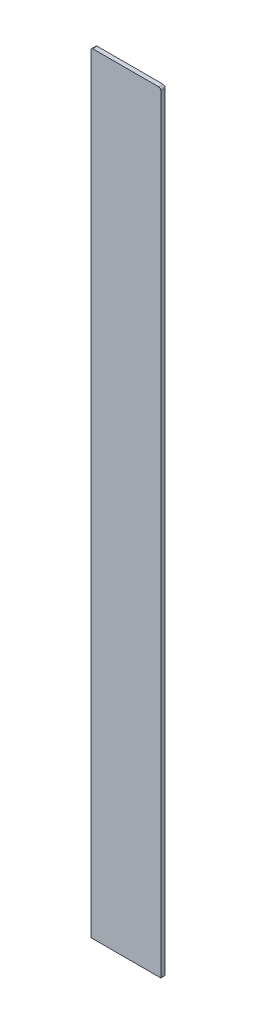
ISO-10303-21;
HEADER;
FILE_DESCRIPTION(('STEP AP214'),'2;1');
FILE_NAME('part.step','',(''),(''),'','','');
FILE_SCHEMA(('AUTOMOTIVE_DESIGN { 1 0 10303 214 1 1 1 1 }'));
ENDSEC;
DATA;
#1=APPLICATION_CONTEXT('core data for automotive mechanical design processes');
#2=APPLICATION_PROTOCOL_DEFINITION('international standard','automotive_design',2000,#1);
#3=PRODUCT_CONTEXT('',#1,'mechanical');
#4=PRODUCT('Part','Part','',(#3));
#5=PRODUCT_RELATED_PRODUCT_CATEGORY('part','',(#4));
#6=PRODUCT_DEFINITION_FORMATION('','',#4);
#7=PRODUCT_DEFINITION_CONTEXT('part definition',#1,'design');
#8=PRODUCT_DEFINITION('design','',#6,#7);
#9=PRODUCT_DEFINITION_SHAPE('','',#8);
#10=(LENGTH_UNIT() NAMED_UNIT(*) SI_UNIT(.MILLI.,.METRE.));
#11=(NAMED_UNIT(*) PLANE_ANGLE_UNIT() SI_UNIT($,.RADIAN.));
#12=(NAMED_UNIT(*) SI_UNIT($,.STERADIAN.) SOLID_ANGLE_UNIT());
#13=UNCERTAINTY_MEASURE_WITH_UNIT(LENGTH_MEASURE(1.E-05),#10,'distance_accuracy_value','');
#14=(GEOMETRIC_REPRESENTATION_CONTEXT(3) GLOBAL_UNCERTAINTY_ASSIGNED_CONTEXT((#13)) GLOBAL_UNIT_ASSIGNED_CONTEXT((#10,
#11,#12)) REPRESENTATION_CONTEXT('',''));
#15=CARTESIAN_POINT('',(0.,0.,0.));
#16=DIRECTION('',(0.,0.,1.));
#17=DIRECTION('',(1.,0.,0.));
#18=AXIS2_PLACEMENT_3D('',#15,#16,#17);
#19=CARTESIAN_POINT('',(4.,0.,0.105));
#20=DIRECTION('',(1.,0.,0.));
#21=DIRECTION('',(0.,1.,0.));
#22=AXIS2_PLACEMENT_3D('',#19,#20,#21);
#23=PLANE('',#22);
#24=DIRECTION('',(0.,0.,-1.));
#25=VECTOR('',#24,1.);
#26=CARTESIAN_POINT('',(4.00000000000001,-84.,0.105));
#27=LINE('',#26,#25);
#28=CARTESIAN_POINT('',(4.00000000000001,-84.,0.305));
#29=VERTEX_POINT('',#28);
#30=CARTESIAN_POINT('',(4.00000000000001,-84.,-0.2));
#31=VERTEX_POINT('',#30);
#32=EDGE_CURVE('E189',#29,#31,#27,.T.);
#33=ORIENTED_EDGE('',*,*,#32,.T.);
#34=DIRECTION('',(0.,-1.,0.));
#35=VECTOR('',#34,1.);
#36=CARTESIAN_POINT('',(4.,0.,-0.2));
#37=LINE('',#36,#35);
#38=CARTESIAN_POINT('',(4.,3.75,-0.2));
#39=VERTEX_POINT('',#38);
#40=EDGE_CURVE('E176',#39,#31,#37,.T.);
#41=ORIENTED_EDGE('',*,*,#40,.F.);
#42=DIRECTION('',(0.,0.,-1.));
#43=VECTOR('',#42,1.);
#44=CARTESIAN_POINT('',(4.,3.75,0.105));
#45=LINE('',#44,#43);
#46=CARTESIAN_POINT('',(4.,3.75,0.305));
#47=VERTEX_POINT('',#46);
#48=EDGE_CURVE('E205',#39,#47,#45,.F.);
#49=ORIENTED_EDGE('',*,*,#48,.T.);
#50=DIRECTION('',(0.,1.,0.));
#51=VECTOR('',#50,1.);
#52=CARTESIAN_POINT('',(4.,0.,0.305));
#53=LINE('',#52,#51);
#54=EDGE_CURVE('E150',#29,#47,#53,.T.);
#55=ORIENTED_EDGE('',*,*,#54,.F.);
#56=EDGE_LOOP('',(#33,#41,#49,#55));
#57=FACE_BOUND('',#56,.T.);
#58=ADVANCED_FACE('F35',(#57),#23,.T.);
#59=CARTESIAN_POINT('',(0.,4.,0.105));
#60=DIRECTION('',(0.,1.,0.));
#61=DIRECTION('',(0.,0.,1.));
#62=AXIS2_PLACEMENT_3D('',#59,#60,#61);
#63=PLANE('',#62);
#64=DIRECTION('',(0.,0.,-1.));
#65=VECTOR('',#64,1.);
#66=CARTESIAN_POINT('',(3.75,4.,0.105));
#67=LINE('',#66,#65);
#68=CARTESIAN_POINT('',(3.75,4.,0.305));
#69=VERTEX_POINT('',#68);
#70=CARTESIAN_POINT('',(3.75,4.,-0.2));
#71=VERTEX_POINT('',#70);
#72=EDGE_CURVE('E125',#69,#71,#67,.T.);
#73=ORIENTED_EDGE('',*,*,#72,.T.);
#74=DIRECTION('',(1.,0.,0.));
#75=VECTOR('',#74,1.);
#76=CARTESIAN_POINT('',(0.,4.,-0.2));
#77=LINE('',#76,#75);
#78=CARTESIAN_POINT('',(-3.75,4.,-0.2));
#79=VERTEX_POINT('',#78);
#80=EDGE_CURVE('E173',#79,#71,#77,.T.);
#81=ORIENTED_EDGE('',*,*,#80,.F.);
#82=DIRECTION('',(0.,0.,-1.));
#83=VECTOR('',#82,1.);
#84=CARTESIAN_POINT('',(-3.75,4.,0.105));
#85=LINE('',#84,#83);
#86=CARTESIAN_POINT('',(-3.75,4.,0.305));
#87=VERTEX_POINT('',#86);
#88=EDGE_CURVE('E135',#79,#87,#85,.F.);
#89=ORIENTED_EDGE('',*,*,#88,.T.);
#90=DIRECTION('',(-1.,0.,0.));
#91=VECTOR('',#90,1.);
#92=CARTESIAN_POINT('',(0.,4.,0.305));
#93=LINE('',#92,#91);
#94=EDGE_CURVE('E139',#69,#87,#93,.T.);
#95=ORIENTED_EDGE('',*,*,#94,.F.);
#96=EDGE_LOOP('',(#73,#81,#89,#95));
#97=FACE_BOUND('',#96,.T.);
#98=ADVANCED_FACE('F140',(#97),#63,.T.);
#99=CARTESIAN_POINT('',(-4.,0.,0.105));
#100=DIRECTION('',(-1.,0.,0.));
#101=DIRECTION('',(0.,0.,1.));
#102=AXIS2_PLACEMENT_3D('',#99,#100,#101);
#103=PLANE('',#102);
#104=DIRECTION('',(0.,0.,-1.));
#105=VECTOR('',#104,1.);
#106=CARTESIAN_POINT('',(-3.99999999999999,-84.,0.105));
#107=LINE('',#106,#105);
#108=CARTESIAN_POINT('',(-3.99999999999999,-84.,0.305));
#109=VERTEX_POINT('',#108);
#110=CARTESIAN_POINT('',(-3.99999999999999,-84.,-0.2));
#111=VERTEX_POINT('',#110);
#112=EDGE_CURVE('E201',#109,#111,#107,.T.);
#113=ORIENTED_EDGE('',*,*,#112,.F.);
#114=DIRECTION('',(0.,-1.,0.));
#115=VECTOR('',#114,1.);
#116=CARTESIAN_POINT('',(-4.,0.,0.305));
#117=LINE('',#116,#115);
#118=CARTESIAN_POINT('',(-4.,3.75,0.305));
#119=VERTEX_POINT('',#118);
#120=EDGE_CURVE('E157',#119,#109,#117,.T.);
#121=ORIENTED_EDGE('',*,*,#120,.F.);
#122=DIRECTION('',(0.,0.,-1.));
#123=VECTOR('',#122,1.);
#124=CARTESIAN_POINT('',(-4.,3.75,0.105));
#125=LINE('',#124,#123);
#126=CARTESIAN_POINT('',(-4.,3.75,-0.2));
#127=VERTEX_POINT('',#126);
#128=EDGE_CURVE('E136',#119,#127,#125,.T.);
#129=ORIENTED_EDGE('',*,*,#128,.T.);
#130=DIRECTION('',(0.,1.,0.));
#131=VECTOR('',#130,1.);
#132=CARTESIAN_POINT('',(-4.,0.,-0.2));
#133=LINE('',#132,#131);
#134=EDGE_CURVE('E167',#111,#127,#133,.T.);
#135=ORIENTED_EDGE('',*,*,#134,.F.);
#136=EDGE_LOOP('',(#113,#121,#129,#135));
#137=FACE_BOUND('',#136,.T.);
#138=ADVANCED_FACE('F251',(#137),#103,.T.);
#139=CARTESIAN_POINT('',(-2.75,0.,0.105));
#140=DIRECTION('',(1.,0.,0.));
#141=DIRECTION('',(0.,1.,0.));
#142=AXIS2_PLACEMENT_3D('',#139,#140,#141);
#143=PLANE('',#142);
#144=DIRECTION('',(0.,-1.,0.));
#145=VECTOR('',#144,1.);
#146=CARTESIAN_POINT('',(-2.75,0.,0.));
#147=LINE('',#146,#145);
#148=CARTESIAN_POINT('',(-2.75,2.5,0.));
#149=VERTEX_POINT('',#148);
#150=CARTESIAN_POINT('',(-2.75,-84.,0.));
#151=VERTEX_POINT('',#150);
#152=EDGE_CURVE('E179',#149,#151,#147,.T.);
#153=ORIENTED_EDGE('',*,*,#152,.F.);
#154=DIRECTION('',(0.,0.,-1.));
#155=VECTOR('',#154,1.);
#156=CARTESIAN_POINT('',(-2.75,2.5,0.105));
#157=LINE('',#156,#155);
#158=CARTESIAN_POINT('',(-2.75,2.5,0.105));
#159=VERTEX_POINT('',#158);
#160=EDGE_CURVE('E211',#149,#159,#157,.F.);
#161=ORIENTED_EDGE('',*,*,#160,.T.);
#162=DIRECTION('',(0.,-1.,0.));
#163=VECTOR('',#162,1.);
#164=CARTESIAN_POINT('',(-2.75,0.,0.105));
#165=LINE('',#164,#163);
#166=CARTESIAN_POINT('',(-2.74999999999999,-84.,0.105));
#167=VERTEX_POINT('',#166);
#168=EDGE_CURVE('E182',#159,#167,#165,.T.);
#169=ORIENTED_EDGE('',*,*,#168,.T.);
#170=DIRECTION('',(0.,0.,-1.));
#171=VECTOR('',#170,1.);
#172=CARTESIAN_POINT('',(-2.74999999999999,-84.,0.105));
#173=LINE('',#172,#171);
#174=EDGE_CURVE('E199',#167,#151,#173,.T.);
#175=ORIENTED_EDGE('',*,*,#174,.T.);
#176=EDGE_LOOP('',(#153,#161,#169,#175));
#177=FACE_BOUND('',#176,.T.);
#178=ADVANCED_FACE('F235',(#177),#143,.T.);
#179=CARTESIAN_POINT('',(0.,2.75,0.105));
#180=DIRECTION('',(0.,1.,0.));
#181=DIRECTION('',(0.,0.,1.));
#182=AXIS2_PLACEMENT_3D('',#179,#180,#181);
#183=PLANE('',#182);
#184=DIRECTION('',(1.,0.,0.));
#185=VECTOR('',#184,1.);
#186=CARTESIAN_POINT('',(0.,2.75,0.105));
#187=LINE('',#186,#185);
#188=CARTESIAN_POINT('',(-2.5,2.75,0.105));
#189=VERTEX_POINT('',#188);
#190=CARTESIAN_POINT('',(2.5,2.75,0.105));
#191=VERTEX_POINT('',#190);
#192=EDGE_CURVE('E184',#189,#191,#187,.T.);
#193=ORIENTED_EDGE('',*,*,#192,.F.);
#194=DIRECTION('',(0.,0.,-1.));
#195=VECTOR('',#194,1.);
#196=CARTESIAN_POINT('',(-2.5,2.75,0.105));
#197=LINE('',#196,#195);
#198=CARTESIAN_POINT('',(-2.5,2.75,0.));
#199=VERTEX_POINT('',#198);
#200=EDGE_CURVE('E208',#189,#199,#197,.T.);
#201=ORIENTED_EDGE('',*,*,#200,.T.);
#202=DIRECTION('',(1.,0.,0.));
#203=VECTOR('',#202,1.);
#204=CARTESIAN_POINT('',(0.,2.75,0.));
#205=LINE('',#204,#203);
#206=CARTESIAN_POINT('',(2.5,2.75,0.));
#207=VERTEX_POINT('',#206);
#208=EDGE_CURVE('E192',#199,#207,#205,.T.);
#209=ORIENTED_EDGE('',*,*,#208,.T.);
#210=DIRECTION('',(0.,0.,-1.));
#211=VECTOR('',#210,1.);
#212=CARTESIAN_POINT('',(2.5,2.75,0.105));
#213=LINE('',#212,#211);
#214=EDGE_CURVE('E58',#207,#191,#213,.F.);
#215=ORIENTED_EDGE('',*,*,#214,.T.);
#216=EDGE_LOOP('',(#193,#201,#209,#215));
#217=FACE_BOUND('',#216,.T.);
#218=ADVANCED_FACE('F243',(#217),#183,.F.);
#219=CARTESIAN_POINT('',(2.75,0.,0.105));
#220=DIRECTION('',(1.,0.,0.));
#221=DIRECTION('',(0.,1.,0.));
#222=AXIS2_PLACEMENT_3D('',#219,#220,#221);
#223=PLANE('',#222);
#224=DIRECTION('',(0.,-1.,0.));
#225=VECTOR('',#224,1.);
#226=CARTESIAN_POINT('',(2.75,0.,0.105));
#227=LINE('',#226,#225);
#228=CARTESIAN_POINT('',(2.75,2.5,0.105));
#229=VERTEX_POINT('',#228);
#230=CARTESIAN_POINT('',(2.75,-84.,0.105));
#231=VERTEX_POINT('',#230);
#232=EDGE_CURVE('E50',#229,#231,#227,.T.);
#233=ORIENTED_EDGE('',*,*,#232,.F.);
#234=DIRECTION('',(0.,0.,-1.));
#235=VECTOR('',#234,1.);
#236=CARTESIAN_POINT('',(2.75,2.5,0.));
#237=LINE('',#236,#235);
#238=CARTESIAN_POINT('',(2.75,2.5,0.));
#239=VERTEX_POINT('',#238);
#240=EDGE_CURVE('E213',#229,#239,#237,.T.);
#241=ORIENTED_EDGE('',*,*,#240,.T.);
#242=DIRECTION('',(0.,-1.,0.));
#243=VECTOR('',#242,1.);
#244=CARTESIAN_POINT('',(2.75,0.,0.));
#245=LINE('',#244,#243);
#246=CARTESIAN_POINT('',(2.75,-84.,0.));
#247=VERTEX_POINT('',#246);
#248=EDGE_CURVE('E185',#239,#247,#245,.T.);
#249=ORIENTED_EDGE('',*,*,#248,.T.);
#250=DIRECTION('',(0.,0.,-1.));
#251=VECTOR('',#250,1.);
#252=CARTESIAN_POINT('',(2.75,-84.,0.105));
#253=LINE('',#252,#251);
#254=EDGE_CURVE('E196',#231,#247,#253,.T.);
#255=ORIENTED_EDGE('',*,*,#254,.F.);
#256=EDGE_LOOP('',(#233,#241,#249,#255));
#257=FACE_BOUND('',#256,.T.);
#258=ADVANCED_FACE('F227',(#257),#223,.F.);
#259=CARTESIAN_POINT('',(0.,-84.,0.105));
#260=DIRECTION('',(0.,1.,0.));
#261=DIRECTION('',(0.,0.,1.));
#262=AXIS2_PLACEMENT_3D('',#259,#260,#261);
#263=PLANE('',#262);
#264=ORIENTED_EDGE('',*,*,#174,.F.);
#265=DIRECTION('',(1.,0.,0.));
#266=VECTOR('',#265,1.);
#267=CARTESIAN_POINT('',(0.,-84.,0.105));
#268=LINE('',#267,#266);
#269=EDGE_CURVE('E151',#167,#231,#268,.T.);
#270=ORIENTED_EDGE('',*,*,#269,.T.);
#271=ORIENTED_EDGE('',*,*,#254,.T.);
#272=DIRECTION('',(-1.,0.,0.));
#273=VECTOR('',#272,1.);
#274=CARTESIAN_POINT('',(0.,-84.,0.));
#275=LINE('',#274,#273);
#276=EDGE_CURVE('E162',#247,#151,#275,.T.);
#277=ORIENTED_EDGE('',*,*,#276,.T.);
#278=EDGE_LOOP('',(#264,#270,#271,#277));
#279=FACE_BOUND('',#278,.T.);
#280=DIRECTION('',(1.,0.,0.));
#281=VECTOR('',#280,1.);
#282=CARTESIAN_POINT('',(0.,-84.,0.305));
#283=LINE('',#282,#281);
#284=EDGE_CURVE('E160',#109,#29,#283,.T.);
#285=ORIENTED_EDGE('',*,*,#284,.F.);
#286=ORIENTED_EDGE('',*,*,#112,.T.);
#287=DIRECTION('',(-1.,0.,0.));
#288=VECTOR('',#287,1.);
#289=CARTESIAN_POINT('',(0.,-84.,-0.2));
#290=LINE('',#289,#288);
#291=EDGE_CURVE('E164',#31,#111,#290,.T.);
#292=ORIENTED_EDGE('',*,*,#291,.F.);
#293=ORIENTED_EDGE('',*,*,#32,.F.);
#294=EDGE_LOOP('',(#285,#286,#292,#293));
#295=FACE_BOUND('',#294,.T.);
#296=ADVANCED_FACE('F230',(#279,#295),#263,.F.);
#297=CARTESIAN_POINT('',(-3.75,3.75,0.105));
#298=DIRECTION('',(0.,0.,-1.));
#299=DIRECTION('',(-1.,0.,0.));
#300=AXIS2_PLACEMENT_3D('',#297,#298,#299);
#301=CYLINDRICAL_SURFACE('',#300,0.25);
#302=ORIENTED_EDGE('',*,*,#128,.F.);
#303=CARTESIAN_POINT('',(-3.75,3.75,0.305));
#304=DIRECTION('',(0.,0.,1.));
#305=DIRECTION('',(1.,0.,0.));
#306=AXIS2_PLACEMENT_3D('',#303,#304,#305);
#307=CIRCLE('',#306,0.25);
#308=EDGE_CURVE('E144',#87,#119,#307,.T.);
#309=ORIENTED_EDGE('',*,*,#308,.F.);
#310=ORIENTED_EDGE('',*,*,#88,.F.);
#311=CARTESIAN_POINT('',(-3.75,3.75,-0.2));
#312=DIRECTION('',(0.,0.,-1.));
#313=DIRECTION('',(-1.,0.,0.));
#314=AXIS2_PLACEMENT_3D('',#311,#312,#313);
#315=CIRCLE('',#314,0.25);
#316=EDGE_CURVE('E170',#127,#79,#315,.T.);
#317=ORIENTED_EDGE('',*,*,#316,.F.);
#318=EDGE_LOOP('',(#302,#309,#310,#317));
#319=FACE_BOUND('',#318,.T.);
#320=ADVANCED_FACE('F262',(#319),#301,.T.);
#321=CARTESIAN_POINT('',(3.75,3.75,0.105));
#322=DIRECTION('',(0.,0.,-1.));
#323=DIRECTION('',(-1.,0.,0.));
#324=AXIS2_PLACEMENT_3D('',#321,#322,#323);
#325=CYLINDRICAL_SURFACE('',#324,0.25);
#326=ORIENTED_EDGE('',*,*,#72,.F.);
#327=CARTESIAN_POINT('',(3.75,3.75,0.305));
#328=DIRECTION('',(0.,0.,1.));
#329=DIRECTION('',(1.,0.,0.));
#330=AXIS2_PLACEMENT_3D('',#327,#328,#329);
#331=CIRCLE('',#330,0.25);
#332=EDGE_CURVE('E129',#47,#69,#331,.T.);
#333=ORIENTED_EDGE('',*,*,#332,.F.);
#334=ORIENTED_EDGE('',*,*,#48,.F.);
#335=CARTESIAN_POINT('',(3.75,3.75,-0.2));
#336=DIRECTION('',(0.,0.,-1.));
#337=DIRECTION('',(-1.,0.,0.));
#338=AXIS2_PLACEMENT_3D('',#335,#336,#337);
#339=CIRCLE('',#338,0.25);
#340=EDGE_CURVE('E131',#71,#39,#339,.T.);
#341=ORIENTED_EDGE('',*,*,#340,.F.);
#342=EDGE_LOOP('',(#326,#333,#334,#341));
#343=FACE_BOUND('',#342,.T.);
#344=ADVANCED_FACE('F127',(#343),#325,.T.);
#345=CARTESIAN_POINT('',(-2.5,2.5,0.105));
#346=DIRECTION('',(0.,0.,-1.));
#347=DIRECTION('',(-1.,0.,0.));
#348=AXIS2_PLACEMENT_3D('',#345,#346,#347);
#349=CYLINDRICAL_SURFACE('',#348,0.25);
#350=CARTESIAN_POINT('',(-2.5,2.5,0.105));
#351=DIRECTION('',(0.,0.,1.));
#352=DIRECTION('',(1.,0.,0.));
#353=AXIS2_PLACEMENT_3D('',#350,#351,#352);
#354=CIRCLE('',#353,0.25);
#355=EDGE_CURVE('E218',#159,#189,#354,.F.);
#356=ORIENTED_EDGE('',*,*,#355,.F.);
#357=ORIENTED_EDGE('',*,*,#160,.F.);
#358=CARTESIAN_POINT('',(-2.5,2.5,0.));
#359=DIRECTION('',(0.,0.,1.));
#360=DIRECTION('',(1.,0.,0.));
#361=AXIS2_PLACEMENT_3D('',#358,#359,#360);
#362=CIRCLE('',#361,0.25);
#363=EDGE_CURVE('E215',#199,#149,#362,.T.);
#364=ORIENTED_EDGE('',*,*,#363,.F.);
#365=ORIENTED_EDGE('',*,*,#200,.F.);
#366=EDGE_LOOP('',(#356,#357,#364,#365));
#367=FACE_BOUND('',#366,.T.);
#368=ADVANCED_FACE('F238',(#367),#349,.F.);
#369=CARTESIAN_POINT('',(2.5,2.5,0.105));
#370=DIRECTION('',(0.,0.,1.));
#371=DIRECTION('',(1.,0.,0.));
#372=AXIS2_PLACEMENT_3D('',#369,#370,#371);
#373=CYLINDRICAL_SURFACE('',#372,0.25);
#374=CARTESIAN_POINT('',(2.5,2.5,0.105));
#375=DIRECTION('',(0.,0.,1.));
#376=DIRECTION('',(1.,0.,0.));
#377=AXIS2_PLACEMENT_3D('',#374,#375,#376);
#378=CIRCLE('',#377,0.25);
#379=EDGE_CURVE('E11',#191,#229,#378,.F.);
#380=ORIENTED_EDGE('',*,*,#379,.F.);
#381=ORIENTED_EDGE('',*,*,#214,.F.);
#382=CARTESIAN_POINT('',(2.5,2.5,0.));
#383=DIRECTION('',(0.,0.,1.));
#384=DIRECTION('',(1.,0.,0.));
#385=AXIS2_PLACEMENT_3D('',#382,#383,#384);
#386=CIRCLE('',#385,0.25);
#387=EDGE_CURVE('E43',#239,#207,#386,.T.);
#388=ORIENTED_EDGE('',*,*,#387,.F.);
#389=ORIENTED_EDGE('',*,*,#240,.F.);
#390=EDGE_LOOP('',(#380,#381,#388,#389));
#391=FACE_BOUND('',#390,.T.);
#392=ADVANCED_FACE('F37',(#391),#373,.F.);
#393=CARTESIAN_POINT('',(0.,0.,-0.2));
#394=DIRECTION('',(0.,0.,-1.));
#395=DIRECTION('',(-1.,0.,0.));
#396=AXIS2_PLACEMENT_3D('',#393,#394,#395);
#397=PLANE('',#396);
#398=ORIENTED_EDGE('',*,*,#291,.T.);
#399=ORIENTED_EDGE('',*,*,#134,.T.);
#400=ORIENTED_EDGE('',*,*,#316,.T.);
#401=ORIENTED_EDGE('',*,*,#80,.T.);
#402=ORIENTED_EDGE('',*,*,#340,.T.);
#403=ORIENTED_EDGE('',*,*,#40,.T.);
#404=EDGE_LOOP('',(#398,#399,#400,#401,#402,#403));
#405=FACE_BOUND('',#404,.T.);
#406=ADVANCED_FACE('F271',(#405),#397,.T.);
#407=CARTESIAN_POINT('',(0.,0.,0.));
#408=DIRECTION('',(0.,0.,-1.));
#409=DIRECTION('',(-1.,0.,0.));
#410=AXIS2_PLACEMENT_3D('',#407,#408,#409);
#411=PLANE('',#410);
#412=ORIENTED_EDGE('',*,*,#248,.F.);
#413=ORIENTED_EDGE('',*,*,#387,.T.);
#414=ORIENTED_EDGE('',*,*,#208,.F.);
#415=ORIENTED_EDGE('',*,*,#363,.T.);
#416=ORIENTED_EDGE('',*,*,#152,.T.);
#417=ORIENTED_EDGE('',*,*,#276,.F.);
#418=EDGE_LOOP('',(#412,#413,#414,#415,#416,#417));
#419=FACE_BOUND('',#418,.T.);
#420=ADVANCED_FACE('F224',(#419),#411,.F.);
#421=CARTESIAN_POINT('',(0.,0.,0.305));
#422=DIRECTION('',(0.,0.,1.));
#423=DIRECTION('',(1.,0.,0.));
#424=AXIS2_PLACEMENT_3D('',#421,#422,#423);
#425=PLANE('',#424);
#426=ORIENTED_EDGE('',*,*,#332,.T.);
#427=ORIENTED_EDGE('',*,*,#94,.T.);
#428=ORIENTED_EDGE('',*,*,#308,.T.);
#429=ORIENTED_EDGE('',*,*,#120,.T.);
#430=ORIENTED_EDGE('',*,*,#284,.T.);
#431=ORIENTED_EDGE('',*,*,#54,.T.);
#432=EDGE_LOOP('',(#426,#427,#428,#429,#430,#431));
#433=FACE_BOUND('',#432,.T.);
#434=ADVANCED_FACE('F147',(#433),#425,.T.);
#435=CARTESIAN_POINT('',(0.,0.,0.105));
#436=DIRECTION('',(0.,0.,1.));
#437=DIRECTION('',(1.,0.,0.));
#438=AXIS2_PLACEMENT_3D('',#435,#436,#437);
#439=PLANE('',#438);
#440=ORIENTED_EDGE('',*,*,#168,.F.);
#441=ORIENTED_EDGE('',*,*,#355,.T.);
#442=ORIENTED_EDGE('',*,*,#192,.T.);
#443=ORIENTED_EDGE('',*,*,#379,.T.);
#444=ORIENTED_EDGE('',*,*,#232,.T.);
#445=ORIENTED_EDGE('',*,*,#269,.F.);
#446=EDGE_LOOP('',(#440,#441,#442,#443,#444,#445));
#447=FACE_BOUND('',#446,.T.);
#448=ADVANCED_FACE('F242',(#447),#439,.F.);
#449=CLOSED_SHELL('',(#58,#98,#138,#178,#218,#258,#296,#320,#344,#368,#392,#406,#420,#434,#448));
#450=MANIFOLD_SOLID_BREP('B2',#449);
#451=ADVANCED_BREP_SHAPE_REPRESENTATION('',(#18,#450),#14);
#452=SHAPE_DEFINITION_REPRESENTATION(#9,#451);
ENDSEC;
END-ISO-10303-21;
